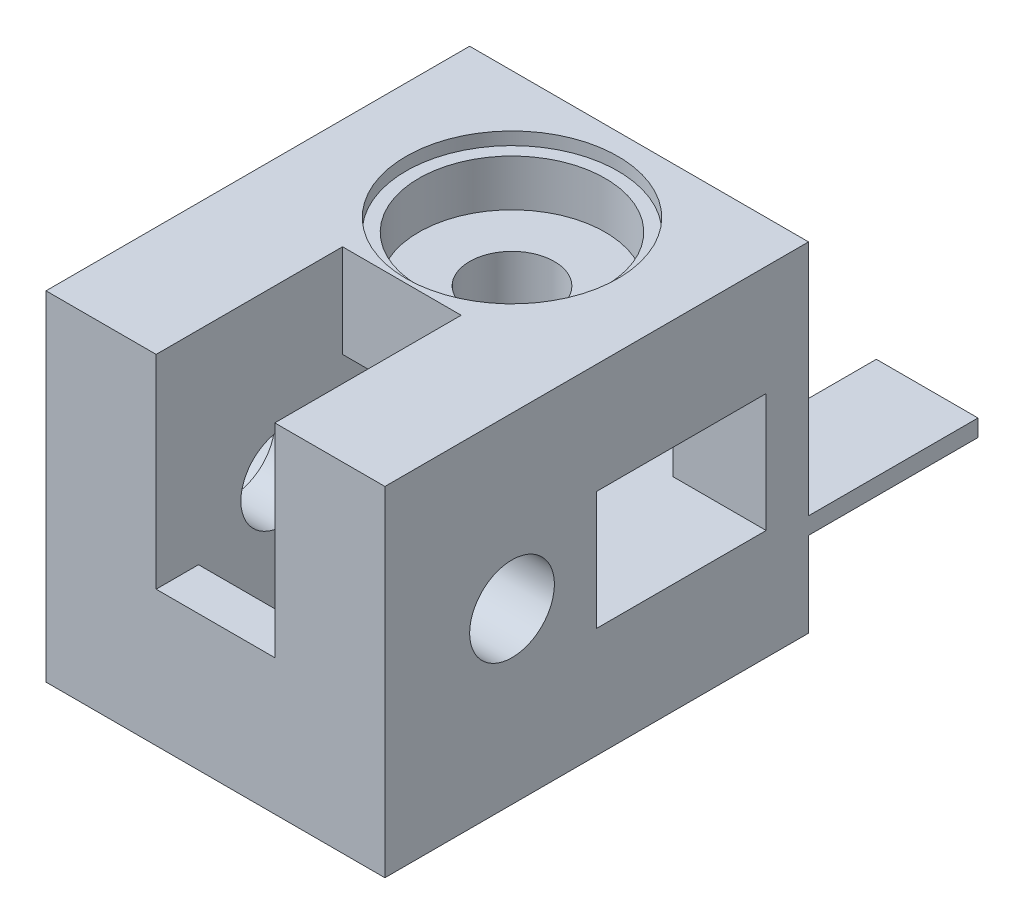
ISO-10303-21;
HEADER;
FILE_DESCRIPTION(('STEP AP214'),'2;1');
FILE_NAME('part.step','',(''),(''),'','','');
FILE_SCHEMA(('AUTOMOTIVE_DESIGN { 1 0 10303 214 1 1 1 1 }'));
ENDSEC;
DATA;
#1=APPLICATION_CONTEXT('core data for automotive mechanical design processes');
#2=APPLICATION_PROTOCOL_DEFINITION('international standard','automotive_design',2000,#1);
#3=PRODUCT_CONTEXT('',#1,'mechanical');
#4=PRODUCT('Part','Part','',(#3));
#5=PRODUCT_RELATED_PRODUCT_CATEGORY('part','',(#4));
#6=PRODUCT_DEFINITION_FORMATION('','',#4);
#7=PRODUCT_DEFINITION_CONTEXT('part definition',#1,'design');
#8=PRODUCT_DEFINITION('design','',#6,#7);
#9=PRODUCT_DEFINITION_SHAPE('','',#8);
#10=(LENGTH_UNIT() NAMED_UNIT(*) SI_UNIT(.MILLI.,.METRE.));
#11=(NAMED_UNIT(*) PLANE_ANGLE_UNIT() SI_UNIT($,.RADIAN.));
#12=(NAMED_UNIT(*) SI_UNIT($,.STERADIAN.) SOLID_ANGLE_UNIT());
#13=UNCERTAINTY_MEASURE_WITH_UNIT(LENGTH_MEASURE(1.E-05),#10,'distance_accuracy_value','');
#14=(GEOMETRIC_REPRESENTATION_CONTEXT(3) GLOBAL_UNCERTAINTY_ASSIGNED_CONTEXT((#13)) GLOBAL_UNIT_ASSIGNED_CONTEXT((#10,
#11,#12)) REPRESENTATION_CONTEXT('',''));
#15=CARTESIAN_POINT('',(0.,0.,0.));
#16=DIRECTION('',(0.,0.,1.));
#17=DIRECTION('',(1.,0.,0.));
#18=AXIS2_PLACEMENT_3D('',#15,#16,#17);
#19=CARTESIAN_POINT('',(0.,0.,0.));
#20=DIRECTION('',(0.,0.,1.));
#21=DIRECTION('',(1.,0.,0.));
#22=AXIS2_PLACEMENT_3D('',#19,#20,#21);
#23=PLANE('',#22);
#24=DIRECTION('',(0.,-1.,0.));
#25=VECTOR('',#24,1.);
#26=CARTESIAN_POINT('',(-10.,10.,0.));
#27=LINE('',#26,#25);
#28=CARTESIAN_POINT('',(-10.,10.,0.));
#29=VERTEX_POINT('',#28);
#30=CARTESIAN_POINT('',(-10.,0.,0.));
#31=VERTEX_POINT('',#30);
#32=EDGE_CURVE('E50',#29,#31,#27,.T.);
#33=ORIENTED_EDGE('',*,*,#32,.F.);
#34=DIRECTION('',(-1.,0.,0.));
#35=VECTOR('',#34,1.);
#36=CARTESIAN_POINT('',(0.,10.,0.));
#37=LINE('',#36,#35);
#38=CARTESIAN_POINT('',(0.,10.,0.));
#39=VERTEX_POINT('',#38);
#40=EDGE_CURVE('E253',#39,#29,#37,.T.);
#41=ORIENTED_EDGE('',*,*,#40,.F.);
#42=DIRECTION('',(0.,1.,0.));
#43=VECTOR('',#42,1.);
#44=CARTESIAN_POINT('',(0.,40.,0.));
#45=LINE('',#44,#43);
#46=CARTESIAN_POINT('',(0.,0.,0.));
#47=VERTEX_POINT('',#46);
#48=EDGE_CURVE('E434',#47,#39,#45,.T.);
#49=ORIENTED_EDGE('',*,*,#48,.F.);
#50=DIRECTION('',(1.,0.,0.));
#51=VECTOR('',#50,1.);
#52=CARTESIAN_POINT('',(-40.,0.,0.));
#53=LINE('',#52,#51);
#54=EDGE_CURVE('E55',#31,#47,#53,.T.);
#55=ORIENTED_EDGE('',*,*,#54,.F.);
#56=EDGE_LOOP('',(#33,#41,#49,#55));
#57=FACE_BOUND('',#56,.T.);
#58=ADVANCED_FACE('F33',(#57),#23,.F.);
#59=DIRECTION('',(1.,0.,0.));
#60=VECTOR('',#59,1.);
#61=CARTESIAN_POINT('',(-12.,12.,0.));
#62=LINE('',#61,#60);
#63=CARTESIAN_POINT('',(-12.,12.,0.));
#64=VERTEX_POINT('',#63);
#65=CARTESIAN_POINT('',(0.,12.,0.));
#66=VERTEX_POINT('',#65);
#67=EDGE_CURVE('E526',#64,#66,#62,.T.);
#68=ORIENTED_EDGE('',*,*,#67,.F.);
#69=DIRECTION('',(0.,1.,0.));
#70=VECTOR('',#69,1.);
#71=CARTESIAN_POINT('',(-12.,0.,0.));
#72=LINE('',#71,#70);
#73=CARTESIAN_POINT('',(-12.,0.,0.));
#74=VERTEX_POINT('',#73);
#75=EDGE_CURVE('E529',#74,#64,#72,.T.);
#76=ORIENTED_EDGE('',*,*,#75,.F.);
#77=CARTESIAN_POINT('',(-40.,0.,0.));
#78=VERTEX_POINT('',#77);
#79=EDGE_CURVE('E237',#78,#74,#53,.T.);
#80=ORIENTED_EDGE('',*,*,#79,.F.);
#81=DIRECTION('',(0.,-1.,0.));
#82=VECTOR('',#81,1.);
#83=CARTESIAN_POINT('',(-40.,40.,0.));
#84=LINE('',#83,#82);
#85=CARTESIAN_POINT('',(-40.,13.,0.));
#86=VERTEX_POINT('',#85);
#87=EDGE_CURVE('E407',#86,#78,#84,.T.);
#88=ORIENTED_EDGE('',*,*,#87,.F.);
#89=DIRECTION('',(-1.,0.,0.));
#90=VECTOR('',#89,1.);
#91=CARTESIAN_POINT('',(-11.,13.,0.));
#92=LINE('',#91,#90);
#93=CARTESIAN_POINT('',(-11.,13.,0.));
#94=VERTEX_POINT('',#93);
#95=EDGE_CURVE('E394',#94,#86,#92,.T.);
#96=ORIENTED_EDGE('',*,*,#95,.F.);
#97=DIRECTION('',(0.,-1.,0.));
#98=VECTOR('',#97,1.);
#99=CARTESIAN_POINT('',(-11.,27.,0.));
#100=LINE('',#99,#98);
#101=CARTESIAN_POINT('',(-11.,27.,0.));
#102=VERTEX_POINT('',#101);
#103=EDGE_CURVE('E376',#102,#94,#100,.T.);
#104=ORIENTED_EDGE('',*,*,#103,.F.);
#105=DIRECTION('',(-1.,0.,0.));
#106=VECTOR('',#105,1.);
#107=CARTESIAN_POINT('',(-11.,27.,0.));
#108=LINE('',#107,#106);
#109=CARTESIAN_POINT('',(-40.,27.,0.));
#110=VERTEX_POINT('',#109);
#111=EDGE_CURVE('E396',#102,#110,#108,.T.);
#112=ORIENTED_EDGE('',*,*,#111,.T.);
#113=CARTESIAN_POINT('',(-40.,40.,0.));
#114=VERTEX_POINT('',#113);
#115=EDGE_CURVE('E421',#114,#110,#84,.T.);
#116=ORIENTED_EDGE('',*,*,#115,.F.);
#117=DIRECTION('',(-1.,0.,0.));
#118=VECTOR('',#117,1.);
#119=CARTESIAN_POINT('',(-40.,40.,0.));
#120=LINE('',#119,#118);
#121=CARTESIAN_POINT('',(0.,40.,0.));
#122=VERTEX_POINT('',#121);
#123=EDGE_CURVE('E412',#122,#114,#120,.T.);
#124=ORIENTED_EDGE('',*,*,#123,.F.);
#125=EDGE_CURVE('E432',#66,#122,#45,.T.);
#126=ORIENTED_EDGE('',*,*,#125,.F.);
#127=EDGE_LOOP('',(#68,#76,#80,#88,#96,#104,#112,#116,#124,#126));
#128=FACE_BOUND('',#127,.T.);
#129=ADVANCED_FACE('F481',(#128),#23,.F.);
#130=CARTESIAN_POINT('',(-33.,20.,35.));
#131=DIRECTION('',(-1.,0.,0.));
#132=DIRECTION('',(0.,0.,1.));
#133=AXIS2_PLACEMENT_3D('',#130,#131,#132);
#134=CYLINDRICAL_SURFACE('',#133,11.);
#135=CARTESIAN_POINT('',(-33.,20.,35.));
#136=DIRECTION('',(-1.,0.,0.));
#137=DIRECTION('',(0.,0.,1.));
#138=AXIS2_PLACEMENT_3D('',#135,#136,#137);
#139=CIRCLE('',#138,11.);
#140=CARTESIAN_POINT('',(-33.,20.,46.));
#141=VERTEX_POINT('',#140);
#142=EDGE_CURVE('E268',#141,#141,#139,.T.);
#143=ORIENTED_EDGE('',*,*,#142,.F.);
#144=EDGE_LOOP('',(#143));
#145=FACE_BOUND('',#144,.T.);
#146=CARTESIAN_POINT('',(-38.5,20.,35.));
#147=DIRECTION('',(-1.,0.,0.));
#148=DIRECTION('',(0.,0.,1.));
#149=AXIS2_PLACEMENT_3D('',#146,#147,#148);
#150=CIRCLE('',#149,11.);
#151=CARTESIAN_POINT('',(-38.5,20.,46.));
#152=VERTEX_POINT('',#151);
#153=EDGE_CURVE('E266',#152,#152,#150,.F.);
#154=ORIENTED_EDGE('',*,*,#153,.F.);
#155=EDGE_LOOP('',(#154));
#156=FACE_BOUND('',#155,.T.);
#157=ADVANCED_FACE('F552',(#145,#156),#134,.F.);
#158=CARTESIAN_POINT('',(0.,20.,35.));
#159=DIRECTION('',(-1.,0.,0.));
#160=DIRECTION('',(0.,0.,1.));
#161=AXIS2_PLACEMENT_3D('',#158,#159,#160);
#162=CYLINDRICAL_SURFACE('',#161,5.);
#163=CARTESIAN_POINT('',(-27.,20.,35.));
#164=DIRECTION('',(-1.,0.,0.));
#165=DIRECTION('',(0.,0.,1.));
#166=AXIS2_PLACEMENT_3D('',#163,#164,#165);
#167=CIRCLE('',#166,5.);
#168=CARTESIAN_POINT('',(-27.,20.,40.));
#169=VERTEX_POINT('',#168);
#170=EDGE_CURVE('E366',#169,#169,#167,.F.);
#171=ORIENTED_EDGE('',*,*,#170,.T.);
#172=EDGE_LOOP('',(#171));
#173=FACE_BOUND('',#172,.T.);
#174=CARTESIAN_POINT('',(-33.,20.,35.));
#175=DIRECTION('',(-1.,0.,0.));
#176=DIRECTION('',(0.,0.,1.));
#177=AXIS2_PLACEMENT_3D('',#174,#175,#176);
#178=CIRCLE('',#177,5.);
#179=CARTESIAN_POINT('',(-33.,20.,40.));
#180=VERTEX_POINT('',#179);
#181=EDGE_CURVE('E271',#180,#180,#178,.F.);
#182=ORIENTED_EDGE('',*,*,#181,.F.);
#183=EDGE_LOOP('',(#182));
#184=FACE_BOUND('',#183,.T.);
#185=ADVANCED_FACE('F583',(#173,#184),#162,.F.);
#186=CARTESIAN_POINT('',(-20.,33.,15.));
#187=DIRECTION('',(0.,1.,0.));
#188=DIRECTION('',(0.,0.,1.));
#189=AXIS2_PLACEMENT_3D('',#186,#187,#188);
#190=CYLINDRICAL_SURFACE('',#189,11.);
#191=CARTESIAN_POINT('',(-20.,33.,15.));
#192=DIRECTION('',(0.,1.,0.));
#193=DIRECTION('',(0.,0.,1.));
#194=AXIS2_PLACEMENT_3D('',#191,#192,#193);
#195=CIRCLE('',#194,11.);
#196=CARTESIAN_POINT('',(-20.,33.,26.));
#197=VERTEX_POINT('',#196);
#198=EDGE_CURVE('E279',#197,#197,#195,.T.);
#199=ORIENTED_EDGE('',*,*,#198,.F.);
#200=EDGE_LOOP('',(#199));
#201=FACE_BOUND('',#200,.T.);
#202=CARTESIAN_POINT('',(-20.,38.5,15.));
#203=DIRECTION('',(0.,1.,0.));
#204=DIRECTION('',(0.,0.,1.));
#205=AXIS2_PLACEMENT_3D('',#202,#203,#204);
#206=CIRCLE('',#205,11.);
#207=CARTESIAN_POINT('',(-20.,38.5,26.));
#208=VERTEX_POINT('',#207);
#209=EDGE_CURVE('E275',#208,#208,#206,.F.);
#210=ORIENTED_EDGE('',*,*,#209,.F.);
#211=EDGE_LOOP('',(#210));
#212=FACE_BOUND('',#211,.T.);
#213=ADVANCED_FACE('F585',(#201,#212),#190,.F.);
#214=CARTESIAN_POINT('',(-20.,0.,15.));
#215=DIRECTION('',(0.,1.,0.));
#216=DIRECTION('',(0.,0.,1.));
#217=AXIS2_PLACEMENT_3D('',#214,#215,#216);
#218=CYLINDRICAL_SURFACE('',#217,5.);
#219=CARTESIAN_POINT('',(-20.,27.,15.));
#220=DIRECTION('',(0.,1.,0.));
#221=DIRECTION('',(0.,0.,1.));
#222=AXIS2_PLACEMENT_3D('',#219,#220,#221);
#223=CIRCLE('',#222,5.);
#224=CARTESIAN_POINT('',(-20.,27.,20.));
#225=VERTEX_POINT('',#224);
#226=EDGE_CURVE('E393',#225,#225,#223,.F.);
#227=ORIENTED_EDGE('',*,*,#226,.T.);
#228=EDGE_LOOP('',(#227));
#229=FACE_BOUND('',#228,.T.);
#230=CARTESIAN_POINT('',(-20.,33.,15.));
#231=DIRECTION('',(0.,1.,0.));
#232=DIRECTION('',(0.,0.,1.));
#233=AXIS2_PLACEMENT_3D('',#230,#231,#232);
#234=CIRCLE('',#233,5.);
#235=CARTESIAN_POINT('',(-20.,33.,20.));
#236=VERTEX_POINT('',#235);
#237=EDGE_CURVE('E282',#236,#236,#234,.F.);
#238=ORIENTED_EDGE('',*,*,#237,.F.);
#239=EDGE_LOOP('',(#238));
#240=FACE_BOUND('',#239,.T.);
#241=ADVANCED_FACE('F577',(#229,#240),#218,.F.);
#242=CARTESIAN_POINT('',(-13.,20.,35.));
#243=DIRECTION('',(1.,0.,0.));
#244=DIRECTION('',(0.,0.,-1.));
#245=AXIS2_PLACEMENT_3D('',#242,#243,#244);
#246=CIRCLE('',#245,5.);
#247=CARTESIAN_POINT('',(-13.,20.,30.));
#248=VERTEX_POINT('',#247);
#249=EDGE_CURVE('E387',#248,#248,#246,.F.);
#250=ORIENTED_EDGE('',*,*,#249,.T.);
#251=EDGE_LOOP('',(#250));
#252=FACE_BOUND('',#251,.T.);
#253=CARTESIAN_POINT('',(0.,20.,35.));
#254=DIRECTION('',(-1.,0.,0.));
#255=DIRECTION('',(0.,0.,1.));
#256=AXIS2_PLACEMENT_3D('',#253,#254,#255);
#257=CIRCLE('',#256,5.);
#258=CARTESIAN_POINT('',(0.,20.,40.));
#259=VERTEX_POINT('',#258);
#260=EDGE_CURVE('E400',#259,#259,#257,.T.);
#261=ORIENTED_EDGE('',*,*,#260,.F.);
#262=EDGE_LOOP('',(#261));
#263=FACE_BOUND('',#262,.T.);
#264=ADVANCED_FACE('F575',(#252,#263),#162,.F.);
#265=CARTESIAN_POINT('',(-20.,13.,15.));
#266=DIRECTION('',(0.,-1.,0.));
#267=DIRECTION('',(0.,0.,-1.));
#268=AXIS2_PLACEMENT_3D('',#265,#266,#267);
#269=CIRCLE('',#268,5.);
#270=CARTESIAN_POINT('',(-20.,13.,10.));
#271=VERTEX_POINT('',#270);
#272=EDGE_CURVE('E404',#271,#271,#269,.F.);
#273=ORIENTED_EDGE('',*,*,#272,.T.);
#274=EDGE_LOOP('',(#273));
#275=FACE_BOUND('',#274,.T.);
#276=CARTESIAN_POINT('',(-20.,0.,15.));
#277=DIRECTION('',(0.,1.,0.));
#278=DIRECTION('',(0.,0.,1.));
#279=AXIS2_PLACEMENT_3D('',#276,#277,#278);
#280=CIRCLE('',#279,5.);
#281=CARTESIAN_POINT('',(-20.,0.,20.));
#282=VERTEX_POINT('',#281);
#283=EDGE_CURVE('E403',#282,#282,#280,.T.);
#284=ORIENTED_EDGE('',*,*,#283,.F.);
#285=EDGE_LOOP('',(#284));
#286=FACE_BOUND('',#285,.T.);
#287=ADVANCED_FACE('F567',(#275,#286),#218,.F.);
#288=CARTESIAN_POINT('',(-40.,40.,50.));
#289=DIRECTION('',(1.,0.,0.));
#290=DIRECTION('',(0.,0.,-1.));
#291=AXIS2_PLACEMENT_3D('',#288,#289,#290);
#292=PLANE('',#291);
#293=CARTESIAN_POINT('',(-40.,20.,35.));
#294=DIRECTION('',(-1.,0.,0.));
#295=DIRECTION('',(0.,0.,1.));
#296=AXIS2_PLACEMENT_3D('',#293,#294,#295);
#297=CIRCLE('',#296,12.5);
#298=CARTESIAN_POINT('',(-40.,20.,47.5));
#299=VERTEX_POINT('',#298);
#300=EDGE_CURVE('E238',#299,#299,#297,.T.);
#301=ORIENTED_EDGE('',*,*,#300,.F.);
#302=EDGE_LOOP('',(#301));
#303=FACE_BOUND('',#302,.T.);
#304=DIRECTION('',(0.,1.,0.));
#305=VECTOR('',#304,1.);
#306=CARTESIAN_POINT('',(-40.,27.,22.));
#307=LINE('',#306,#305);
#308=CARTESIAN_POINT('',(-40.,13.,22.));
#309=VERTEX_POINT('',#308);
#310=CARTESIAN_POINT('',(-40.,27.,22.));
#311=VERTEX_POINT('',#310);
#312=EDGE_CURVE('E383',#309,#311,#307,.T.);
#313=ORIENTED_EDGE('',*,*,#312,.F.);
#314=DIRECTION('',(0.,0.,1.));
#315=VECTOR('',#314,1.);
#316=CARTESIAN_POINT('',(-40.,13.,22.));
#317=LINE('',#316,#315);
#318=EDGE_CURVE('E377',#86,#309,#317,.T.);
#319=ORIENTED_EDGE('',*,*,#318,.F.);
#320=ORIENTED_EDGE('',*,*,#87,.T.);
#321=DIRECTION('',(0.,0.,-1.));
#322=VECTOR('',#321,1.);
#323=CARTESIAN_POINT('',(-40.,0.,50.));
#324=LINE('',#323,#322);
#325=CARTESIAN_POINT('',(-40.,0.,50.));
#326=VERTEX_POINT('',#325);
#327=EDGE_CURVE('E450',#326,#78,#324,.T.);
#328=ORIENTED_EDGE('',*,*,#327,.F.);
#329=DIRECTION('',(0.,-1.,0.));
#330=VECTOR('',#329,1.);
#331=CARTESIAN_POINT('',(-40.,40.,50.));
#332=LINE('',#331,#330);
#333=CARTESIAN_POINT('',(-40.,40.,50.));
#334=VERTEX_POINT('',#333);
#335=EDGE_CURVE('E408',#334,#326,#332,.T.);
#336=ORIENTED_EDGE('',*,*,#335,.F.);
#337=DIRECTION('',(0.,0.,-1.));
#338=VECTOR('',#337,1.);
#339=CARTESIAN_POINT('',(-40.,40.,50.));
#340=LINE('',#339,#338);
#341=EDGE_CURVE('E420',#334,#114,#340,.T.);
#342=ORIENTED_EDGE('',*,*,#341,.T.);
#343=ORIENTED_EDGE('',*,*,#115,.T.);
#344=DIRECTION('',(0.,0.,-1.));
#345=VECTOR('',#344,1.);
#346=CARTESIAN_POINT('',(-40.,27.,22.));
#347=LINE('',#346,#345);
#348=EDGE_CURVE('E386',#311,#110,#347,.T.);
#349=ORIENTED_EDGE('',*,*,#348,.F.);
#350=EDGE_LOOP('',(#313,#319,#320,#328,#336,#342,#343,#349));
#351=FACE_BOUND('',#350,.T.);
#352=ADVANCED_FACE('F35',(#303,#351),#292,.F.);
#353=CARTESIAN_POINT('',(-40.,0.,50.));
#354=DIRECTION('',(0.,1.,0.));
#355=DIRECTION('',(0.,0.,1.));
#356=AXIS2_PLACEMENT_3D('',#353,#354,#355);
#357=PLANE('',#356);
#358=DIRECTION('',(-1.,0.,0.));
#359=VECTOR('',#358,1.);
#360=CARTESIAN_POINT('',(-13.,0.,45.));
#361=LINE('',#360,#359);
#362=CARTESIAN_POINT('',(-13.,0.,45.));
#363=VERTEX_POINT('',#362);
#364=CARTESIAN_POINT('',(-27.,0.,45.));
#365=VERTEX_POINT('',#364);
#366=EDGE_CURVE('E355',#363,#365,#361,.T.);
#367=ORIENTED_EDGE('',*,*,#366,.F.);
#368=DIRECTION('',(0.,0.,1.));
#369=VECTOR('',#368,1.);
#370=CARTESIAN_POINT('',(-13.,0.,25.));
#371=LINE('',#370,#369);
#372=CARTESIAN_POINT('',(-13.,0.,25.));
#373=VERTEX_POINT('',#372);
#374=EDGE_CURVE('E342',#373,#363,#371,.T.);
#375=ORIENTED_EDGE('',*,*,#374,.F.);
#376=DIRECTION('',(1.,0.,0.));
#377=VECTOR('',#376,1.);
#378=CARTESIAN_POINT('',(-13.,0.,25.));
#379=LINE('',#378,#377);
#380=CARTESIAN_POINT('',(-27.,0.,25.));
#381=VERTEX_POINT('',#380);
#382=EDGE_CURVE('E347',#381,#373,#379,.T.);
#383=ORIENTED_EDGE('',*,*,#382,.F.);
#384=DIRECTION('',(0.,0.,-1.));
#385=VECTOR('',#384,1.);
#386=CARTESIAN_POINT('',(-27.,0.,25.));
#387=LINE('',#386,#385);
#388=EDGE_CURVE('E358',#365,#381,#387,.T.);
#389=ORIENTED_EDGE('',*,*,#388,.F.);
#390=EDGE_LOOP('',(#367,#375,#383,#389));
#391=FACE_BOUND('',#390,.T.);
#392=ORIENTED_EDGE('',*,*,#283,.T.);
#393=EDGE_LOOP('',(#392));
#394=FACE_BOUND('',#393,.T.);
#395=ORIENTED_EDGE('',*,*,#79,.T.);
#396=DIRECTION('',(0.,0.,1.));
#397=VECTOR('',#396,1.);
#398=CARTESIAN_POINT('',(-12.,0.,-20.));
#399=LINE('',#398,#397);
#400=CARTESIAN_POINT('',(-12.,0.,-20.));
#401=VERTEX_POINT('',#400);
#402=EDGE_CURVE('E217',#401,#74,#399,.T.);
#403=ORIENTED_EDGE('',*,*,#402,.F.);
#404=DIRECTION('',(-1.,0.,0.));
#405=VECTOR('',#404,1.);
#406=CARTESIAN_POINT('',(-10.,0.,-20.));
#407=LINE('',#406,#405);
#408=CARTESIAN_POINT('',(-10.,0.,-20.));
#409=VERTEX_POINT('',#408);
#410=EDGE_CURVE('E223',#409,#401,#407,.T.);
#411=ORIENTED_EDGE('',*,*,#410,.F.);
#412=DIRECTION('',(0.,0.,1.));
#413=VECTOR('',#412,1.);
#414=CARTESIAN_POINT('',(-10.,0.,-20.));
#415=LINE('',#414,#413);
#416=EDGE_CURVE('E254',#409,#31,#415,.T.);
#417=ORIENTED_EDGE('',*,*,#416,.T.);
#418=ORIENTED_EDGE('',*,*,#54,.T.);
#419=DIRECTION('',(0.,0.,-1.));
#420=VECTOR('',#419,1.);
#421=CARTESIAN_POINT('',(0.,0.,50.));
#422=LINE('',#421,#420);
#423=CARTESIAN_POINT('',(0.,0.,50.));
#424=VERTEX_POINT('',#423);
#425=EDGE_CURVE('E460',#424,#47,#422,.T.);
#426=ORIENTED_EDGE('',*,*,#425,.F.);
#427=DIRECTION('',(1.,0.,0.));
#428=VECTOR('',#427,1.);
#429=CARTESIAN_POINT('',(-40.,0.,50.));
#430=LINE('',#429,#428);
#431=EDGE_CURVE('E411',#326,#424,#430,.T.);
#432=ORIENTED_EDGE('',*,*,#431,.F.);
#433=ORIENTED_EDGE('',*,*,#327,.T.);
#434=EDGE_LOOP('',(#395,#403,#411,#417,#418,#426,#432,#433));
#435=FACE_BOUND('',#434,.T.);
#436=ADVANCED_FACE('F234',(#391,#394,#435),#357,.F.);
#437=CARTESIAN_POINT('',(0.,40.,50.));
#438=DIRECTION('',(-1.,0.,0.));
#439=DIRECTION('',(0.,-1.,0.));
#440=AXIS2_PLACEMENT_3D('',#437,#438,#439);
#441=PLANE('',#440);
#442=DIRECTION('',(0.,0.,-1.));
#443=VECTOR('',#442,1.);
#444=CARTESIAN_POINT('',(0.,13.,5.));
#445=LINE('',#444,#443);
#446=CARTESIAN_POINT('',(0.,13.,25.));
#447=VERTEX_POINT('',#446);
#448=CARTESIAN_POINT('',(0.,13.,5.));
#449=VERTEX_POINT('',#448);
#450=EDGE_CURVE('E320',#447,#449,#445,.T.);
#451=ORIENTED_EDGE('',*,*,#450,.F.);
#452=DIRECTION('',(0.,-1.,0.));
#453=VECTOR('',#452,1.);
#454=CARTESIAN_POINT('',(0.,27.,25.));
#455=LINE('',#454,#453);
#456=CARTESIAN_POINT('',(0.,27.,25.));
#457=VERTEX_POINT('',#456);
#458=EDGE_CURVE('E302',#457,#447,#455,.T.);
#459=ORIENTED_EDGE('',*,*,#458,.F.);
#460=DIRECTION('',(0.,0.,1.));
#461=VECTOR('',#460,1.);
#462=CARTESIAN_POINT('',(0.,27.,5.));
#463=LINE('',#462,#461);
#464=CARTESIAN_POINT('',(0.,27.,5.));
#465=VERTEX_POINT('',#464);
#466=EDGE_CURVE('E313',#465,#457,#463,.T.);
#467=ORIENTED_EDGE('',*,*,#466,.F.);
#468=DIRECTION('',(0.,1.,0.));
#469=VECTOR('',#468,1.);
#470=CARTESIAN_POINT('',(0.,27.,5.));
#471=LINE('',#470,#469);
#472=EDGE_CURVE('E323',#449,#465,#471,.T.);
#473=ORIENTED_EDGE('',*,*,#472,.F.);
#474=EDGE_LOOP('',(#451,#459,#467,#473));
#475=FACE_BOUND('',#474,.T.);
#476=ORIENTED_EDGE('',*,*,#260,.T.);
#477=EDGE_LOOP('',(#476));
#478=FACE_BOUND('',#477,.T.);
#479=ORIENTED_EDGE('',*,*,#48,.T.);
#480=DIRECTION('',(0.,0.,1.));
#481=VECTOR('',#480,1.);
#482=CARTESIAN_POINT('',(0.,10.,-20.));
#483=LINE('',#482,#481);
#484=CARTESIAN_POINT('',(0.,10.,-20.));
#485=VERTEX_POINT('',#484);
#486=EDGE_CURVE('E263',#485,#39,#483,.T.);
#487=ORIENTED_EDGE('',*,*,#486,.F.);
#488=DIRECTION('',(0.,-1.,0.));
#489=VECTOR('',#488,1.);
#490=CARTESIAN_POINT('',(0.,12.,-20.));
#491=LINE('',#490,#489);
#492=CARTESIAN_POINT('',(0.,12.,-20.));
#493=VERTEX_POINT('',#492);
#494=EDGE_CURVE('E545',#493,#485,#491,.T.);
#495=ORIENTED_EDGE('',*,*,#494,.F.);
#496=DIRECTION('',(0.,0.,1.));
#497=VECTOR('',#496,1.);
#498=CARTESIAN_POINT('',(0.,12.,-20.));
#499=LINE('',#498,#497);
#500=EDGE_CURVE('E243',#493,#66,#499,.T.);
#501=ORIENTED_EDGE('',*,*,#500,.T.);
#502=ORIENTED_EDGE('',*,*,#125,.T.);
#503=DIRECTION('',(0.,0.,-1.));
#504=VECTOR('',#503,1.);
#505=CARTESIAN_POINT('',(0.,40.,50.));
#506=LINE('',#505,#504);
#507=CARTESIAN_POINT('',(0.,40.,50.));
#508=VERTEX_POINT('',#507);
#509=EDGE_CURVE('E463',#508,#122,#506,.T.);
#510=ORIENTED_EDGE('',*,*,#509,.F.);
#511=DIRECTION('',(0.,1.,0.));
#512=VECTOR('',#511,1.);
#513=CARTESIAN_POINT('',(0.,40.,50.));
#514=LINE('',#513,#512);
#515=EDGE_CURVE('E414',#424,#508,#514,.T.);
#516=ORIENTED_EDGE('',*,*,#515,.F.);
#517=ORIENTED_EDGE('',*,*,#425,.T.);
#518=EDGE_LOOP('',(#479,#487,#495,#501,#502,#510,#516,#517));
#519=FACE_BOUND('',#518,.T.);
#520=ADVANCED_FACE('F521',(#475,#478,#519),#441,.F.);
#521=CARTESIAN_POINT('',(-40.,40.,50.));
#522=DIRECTION('',(0.,-1.,0.));
#523=DIRECTION('',(0.,0.,-1.));
#524=AXIS2_PLACEMENT_3D('',#521,#522,#523);
#525=PLANE('',#524);
#526=CARTESIAN_POINT('',(-20.,40.,15.));
#527=DIRECTION('',(0.,1.,0.));
#528=DIRECTION('',(0.,0.,1.));
#529=AXIS2_PLACEMENT_3D('',#526,#527,#528);
#530=CIRCLE('',#529,12.5);
#531=CARTESIAN_POINT('',(-20.,40.,27.5));
#532=VERTEX_POINT('',#531);
#533=EDGE_CURVE('E276',#532,#532,#530,.T.);
#534=ORIENTED_EDGE('',*,*,#533,.F.);
#535=EDGE_LOOP('',(#534));
#536=FACE_BOUND('',#535,.T.);
#537=DIRECTION('',(-1.,0.,0.));
#538=VECTOR('',#537,1.);
#539=CARTESIAN_POINT('',(-40.,40.,50.));
#540=LINE('',#539,#538);
#541=CARTESIAN_POINT('',(-27.,40.,50.));
#542=VERTEX_POINT('',#541);
#543=EDGE_CURVE('E416',#542,#334,#540,.T.);
#544=ORIENTED_EDGE('',*,*,#543,.F.);
#545=DIRECTION('',(0.,0.,1.));
#546=VECTOR('',#545,1.);
#547=CARTESIAN_POINT('',(-27.,40.,50.));
#548=LINE('',#547,#546);
#549=CARTESIAN_POINT('',(-27.,40.,28.));
#550=VERTEX_POINT('',#549);
#551=EDGE_CURVE('E293',#550,#542,#548,.T.);
#552=ORIENTED_EDGE('',*,*,#551,.F.);
#553=DIRECTION('',(-1.,0.,0.));
#554=VECTOR('',#553,1.);
#555=CARTESIAN_POINT('',(-27.,40.,28.));
#556=LINE('',#555,#554);
#557=CARTESIAN_POINT('',(-13.,40.,28.));
#558=VERTEX_POINT('',#557);
#559=EDGE_CURVE('E287',#558,#550,#556,.T.);
#560=ORIENTED_EDGE('',*,*,#559,.F.);
#561=DIRECTION('',(0.,0.,-1.));
#562=VECTOR('',#561,1.);
#563=CARTESIAN_POINT('',(-13.,40.,50.));
#564=LINE('',#563,#562);
#565=CARTESIAN_POINT('',(-13.,40.,50.));
#566=VERTEX_POINT('',#565);
#567=EDGE_CURVE('E295',#566,#558,#564,.T.);
#568=ORIENTED_EDGE('',*,*,#567,.F.);
#569=EDGE_CURVE('E417',#508,#566,#540,.T.);
#570=ORIENTED_EDGE('',*,*,#569,.F.);
#571=ORIENTED_EDGE('',*,*,#509,.T.);
#572=ORIENTED_EDGE('',*,*,#123,.T.);
#573=ORIENTED_EDGE('',*,*,#341,.F.);
#574=EDGE_LOOP('',(#544,#552,#560,#568,#570,#571,#572,#573));
#575=FACE_BOUND('',#574,.T.);
#576=ADVANCED_FACE('F471',(#536,#575),#525,.F.);
#577=CARTESIAN_POINT('',(0.,0.,50.));
#578=DIRECTION('',(0.,0.,1.));
#579=DIRECTION('',(1.,0.,0.));
#580=AXIS2_PLACEMENT_3D('',#577,#578,#579);
#581=PLANE('',#580);
#582=DIRECTION('',(0.,1.,0.));
#583=VECTOR('',#582,1.);
#584=CARTESIAN_POINT('',(-27.,16.,50.));
#585=LINE('',#584,#583);
#586=CARTESIAN_POINT('',(-27.,16.,50.));
#587=VERTEX_POINT('',#586);
#588=EDGE_CURVE('E292',#587,#542,#585,.T.);
#589=ORIENTED_EDGE('',*,*,#588,.T.);
#590=ORIENTED_EDGE('',*,*,#543,.T.);
#591=ORIENTED_EDGE('',*,*,#335,.T.);
#592=ORIENTED_EDGE('',*,*,#431,.T.);
#593=ORIENTED_EDGE('',*,*,#515,.T.);
#594=ORIENTED_EDGE('',*,*,#569,.T.);
#595=DIRECTION('',(0.,1.,0.));
#596=VECTOR('',#595,1.);
#597=CARTESIAN_POINT('',(-13.,16.,50.));
#598=LINE('',#597,#596);
#599=CARTESIAN_POINT('',(-13.,16.,50.));
#600=VERTEX_POINT('',#599);
#601=EDGE_CURVE('E305',#600,#566,#598,.T.);
#602=ORIENTED_EDGE('',*,*,#601,.F.);
#603=DIRECTION('',(1.,0.,0.));
#604=VECTOR('',#603,1.);
#605=CARTESIAN_POINT('',(-27.,16.,50.));
#606=LINE('',#605,#604);
#607=EDGE_CURVE('E286',#587,#600,#606,.T.);
#608=ORIENTED_EDGE('',*,*,#607,.F.);
#609=EDGE_LOOP('',(#589,#590,#591,#592,#593,#594,#602,#608));
#610=FACE_BOUND('',#609,.T.);
#611=ADVANCED_FACE('F502',(#610),#581,.T.);
#612=CARTESIAN_POINT('',(-11.,13.,22.));
#613=DIRECTION('',(0.,-1.,0.));
#614=DIRECTION('',(0.,0.,-1.));
#615=AXIS2_PLACEMENT_3D('',#612,#613,#614);
#616=PLANE('',#615);
#617=DIRECTION('',(1.,0.,0.));
#618=VECTOR('',#617,1.);
#619=CARTESIAN_POINT('',(-24.,13.,5.));
#620=LINE('',#619,#618);
#621=CARTESIAN_POINT('',(-11.,13.,5.));
#622=VERTEX_POINT('',#621);
#623=EDGE_CURVE('E335',#622,#449,#620,.T.);
#624=ORIENTED_EDGE('',*,*,#623,.F.);
#625=DIRECTION('',(0.,0.,1.));
#626=VECTOR('',#625,1.);
#627=CARTESIAN_POINT('',(-11.,13.,22.));
#628=LINE('',#627,#626);
#629=EDGE_CURVE('E379',#94,#622,#628,.T.);
#630=ORIENTED_EDGE('',*,*,#629,.F.);
#631=ORIENTED_EDGE('',*,*,#95,.T.);
#632=ORIENTED_EDGE('',*,*,#318,.T.);
#633=DIRECTION('',(-1.,0.,0.));
#634=VECTOR('',#633,1.);
#635=CARTESIAN_POINT('',(-11.,13.,22.));
#636=LINE('',#635,#634);
#637=CARTESIAN_POINT('',(-24.,13.,22.));
#638=VERTEX_POINT('',#637);
#639=EDGE_CURVE('E391',#638,#309,#636,.T.);
#640=ORIENTED_EDGE('',*,*,#639,.F.);
#641=DIRECTION('',(0.,0.,-1.));
#642=VECTOR('',#641,1.);
#643=CARTESIAN_POINT('',(-24.,13.,5.));
#644=LINE('',#643,#642);
#645=CARTESIAN_POINT('',(-24.,13.,25.));
#646=VERTEX_POINT('',#645);
#647=EDGE_CURVE('E312',#646,#638,#644,.T.);
#648=ORIENTED_EDGE('',*,*,#647,.F.);
#649=DIRECTION('',(1.,0.,0.));
#650=VECTOR('',#649,1.);
#651=CARTESIAN_POINT('',(-24.,13.,25.));
#652=LINE('',#651,#650);
#653=CARTESIAN_POINT('',(-13.,13.,25.));
#654=VERTEX_POINT('',#653);
#655=EDGE_CURVE('E337',#646,#654,#652,.T.);
#656=ORIENTED_EDGE('',*,*,#655,.T.);
#657=EDGE_CURVE('E318',#654,#447,#652,.T.);
#658=ORIENTED_EDGE('',*,*,#657,.T.);
#659=ORIENTED_EDGE('',*,*,#450,.T.);
#660=EDGE_LOOP('',(#624,#630,#631,#632,#640,#648,#656,#658,#659));
#661=FACE_BOUND('',#660,.T.);
#662=ORIENTED_EDGE('',*,*,#272,.F.);
#663=EDGE_LOOP('',(#662));
#664=FACE_BOUND('',#663,.T.);
#665=ADVANCED_FACE('F496',(#661,#664),#616,.F.);
#666=CARTESIAN_POINT('',(-11.,27.,22.));
#667=DIRECTION('',(0.,1.,0.));
#668=DIRECTION('',(0.,0.,1.));
#669=AXIS2_PLACEMENT_3D('',#666,#667,#668);
#670=PLANE('',#669);
#671=ORIENTED_EDGE('',*,*,#226,.F.);
#672=EDGE_LOOP('',(#671));
#673=FACE_BOUND('',#672,.T.);
#674=DIRECTION('',(0.,0.,-1.));
#675=VECTOR('',#674,1.);
#676=CARTESIAN_POINT('',(-11.,27.,22.));
#677=LINE('',#676,#675);
#678=CARTESIAN_POINT('',(-11.,27.,5.));
#679=VERTEX_POINT('',#678);
#680=EDGE_CURVE('E374',#679,#102,#677,.T.);
#681=ORIENTED_EDGE('',*,*,#680,.F.);
#682=DIRECTION('',(1.,0.,0.));
#683=VECTOR('',#682,1.);
#684=CARTESIAN_POINT('',(-24.,27.,5.));
#685=LINE('',#684,#683);
#686=EDGE_CURVE('E333',#679,#465,#685,.T.);
#687=ORIENTED_EDGE('',*,*,#686,.T.);
#688=ORIENTED_EDGE('',*,*,#466,.T.);
#689=DIRECTION('',(1.,0.,0.));
#690=VECTOR('',#689,1.);
#691=CARTESIAN_POINT('',(-24.,27.,25.));
#692=LINE('',#691,#690);
#693=CARTESIAN_POINT('',(-13.,27.,25.));
#694=VERTEX_POINT('',#693);
#695=EDGE_CURVE('E332',#694,#457,#692,.T.);
#696=ORIENTED_EDGE('',*,*,#695,.F.);
#697=CARTESIAN_POINT('',(-24.,27.,25.));
#698=VERTEX_POINT('',#697);
#699=EDGE_CURVE('E328',#698,#694,#692,.T.);
#700=ORIENTED_EDGE('',*,*,#699,.F.);
#701=DIRECTION('',(0.,0.,1.));
#702=VECTOR('',#701,1.);
#703=CARTESIAN_POINT('',(-24.,27.,5.));
#704=LINE('',#703,#702);
#705=CARTESIAN_POINT('',(-24.,27.,22.));
#706=VERTEX_POINT('',#705);
#707=EDGE_CURVE('E315',#706,#698,#704,.T.);
#708=ORIENTED_EDGE('',*,*,#707,.F.);
#709=DIRECTION('',(-1.,0.,0.));
#710=VECTOR('',#709,1.);
#711=CARTESIAN_POINT('',(-11.,27.,22.));
#712=LINE('',#711,#710);
#713=EDGE_CURVE('E382',#706,#311,#712,.T.);
#714=ORIENTED_EDGE('',*,*,#713,.T.);
#715=ORIENTED_EDGE('',*,*,#348,.T.);
#716=ORIENTED_EDGE('',*,*,#111,.F.);
#717=EDGE_LOOP('',(#681,#687,#688,#696,#700,#708,#714,#715,#716));
#718=FACE_BOUND('',#717,.T.);
#719=ADVANCED_FACE('F487',(#673,#718),#670,.F.);
#720=CARTESIAN_POINT('',(-11.,27.,22.));
#721=DIRECTION('',(0.,0.,1.));
#722=DIRECTION('',(1.,0.,0.));
#723=AXIS2_PLACEMENT_3D('',#720,#721,#722);
#724=PLANE('',#723);
#725=ORIENTED_EDGE('',*,*,#713,.F.);
#726=DIRECTION('',(0.,-1.,0.));
#727=VECTOR('',#726,1.);
#728=CARTESIAN_POINT('',(-24.,27.,22.));
#729=LINE('',#728,#727);
#730=EDGE_CURVE('E331',#706,#638,#729,.T.);
#731=ORIENTED_EDGE('',*,*,#730,.T.);
#732=ORIENTED_EDGE('',*,*,#639,.T.);
#733=ORIENTED_EDGE('',*,*,#312,.T.);
#734=EDGE_LOOP('',(#725,#731,#732,#733));
#735=FACE_BOUND('',#734,.T.);
#736=ADVANCED_FACE('F493',(#735),#724,.F.);
#737=CARTESIAN_POINT('',(-11.,0.,0.));
#738=DIRECTION('',(1.,0.,0.));
#739=DIRECTION('',(0.,0.,-1.));
#740=AXIS2_PLACEMENT_3D('',#737,#738,#739);
#741=PLANE('',#740);
#742=ORIENTED_EDGE('',*,*,#629,.T.);
#743=DIRECTION('',(0.,1.,0.));
#744=VECTOR('',#743,1.);
#745=CARTESIAN_POINT('',(-11.,0.,5.));
#746=LINE('',#745,#744);
#747=EDGE_CURVE('E447',#622,#679,#746,.T.);
#748=ORIENTED_EDGE('',*,*,#747,.T.);
#749=ORIENTED_EDGE('',*,*,#680,.T.);
#750=ORIENTED_EDGE('',*,*,#103,.T.);
#751=EDGE_LOOP('',(#742,#748,#749,#750));
#752=FACE_BOUND('',#751,.T.);
#753=ADVANCED_FACE('F644',(#752),#741,.F.);
#754=CARTESIAN_POINT('',(-13.,29.,25.));
#755=DIRECTION('',(1.,0.,0.));
#756=DIRECTION('',(0.,0.,-1.));
#757=AXIS2_PLACEMENT_3D('',#754,#755,#756);
#758=PLANE('',#757);
#759=DIRECTION('',(0.,1.,0.));
#760=VECTOR('',#759,1.);
#761=CARTESIAN_POINT('',(-13.,16.,28.));
#762=LINE('',#761,#760);
#763=CARTESIAN_POINT('',(-13.,29.,28.));
#764=VERTEX_POINT('',#763);
#765=EDGE_CURVE('E303',#764,#558,#762,.T.);
#766=ORIENTED_EDGE('',*,*,#765,.F.);
#767=DIRECTION('',(0.,0.,1.));
#768=VECTOR('',#767,1.);
#769=CARTESIAN_POINT('',(-13.,29.,25.));
#770=LINE('',#769,#768);
#771=CARTESIAN_POINT('',(-13.,29.,25.));
#772=VERTEX_POINT('',#771);
#773=EDGE_CURVE('E343',#772,#764,#770,.T.);
#774=ORIENTED_EDGE('',*,*,#773,.F.);
#775=DIRECTION('',(0.,-1.,0.));
#776=VECTOR('',#775,1.);
#777=CARTESIAN_POINT('',(-13.,29.,25.));
#778=LINE('',#777,#776);
#779=EDGE_CURVE('E363',#772,#694,#778,.T.);
#780=ORIENTED_EDGE('',*,*,#779,.T.);
#781=EDGE_CURVE('E367',#694,#654,#778,.T.);
#782=ORIENTED_EDGE('',*,*,#781,.T.);
#783=EDGE_CURVE('E368',#654,#373,#778,.T.);
#784=ORIENTED_EDGE('',*,*,#783,.T.);
#785=ORIENTED_EDGE('',*,*,#374,.T.);
#786=DIRECTION('',(0.,-1.,0.));
#787=VECTOR('',#786,1.);
#788=CARTESIAN_POINT('',(-13.,29.,45.));
#789=LINE('',#788,#787);
#790=CARTESIAN_POINT('',(-13.,16.,45.));
#791=VERTEX_POINT('',#790);
#792=EDGE_CURVE('E352',#791,#363,#789,.T.);
#793=ORIENTED_EDGE('',*,*,#792,.F.);
#794=DIRECTION('',(0.,0.,-1.));
#795=VECTOR('',#794,1.);
#796=CARTESIAN_POINT('',(-13.,16.,50.));
#797=LINE('',#796,#795);
#798=EDGE_CURVE('E290',#600,#791,#797,.T.);
#799=ORIENTED_EDGE('',*,*,#798,.F.);
#800=ORIENTED_EDGE('',*,*,#601,.T.);
#801=ORIENTED_EDGE('',*,*,#567,.T.);
#802=EDGE_LOOP('',(#766,#774,#780,#782,#784,#785,#793,#799,#800,#801));
#803=FACE_BOUND('',#802,.T.);
#804=ORIENTED_EDGE('',*,*,#249,.F.);
#805=EDGE_LOOP('',(#804));
#806=FACE_BOUND('',#805,.T.);
#807=ADVANCED_FACE('F517',(#803,#806),#758,.F.);
#808=CARTESIAN_POINT('',(-27.,29.,25.));
#809=DIRECTION('',(-1.,0.,0.));
#810=DIRECTION('',(0.,0.,1.));
#811=AXIS2_PLACEMENT_3D('',#808,#809,#810);
#812=PLANE('',#811);
#813=ORIENTED_EDGE('',*,*,#170,.F.);
#814=EDGE_LOOP('',(#813));
#815=FACE_BOUND('',#814,.T.);
#816=DIRECTION('',(0.,0.,-1.));
#817=VECTOR('',#816,1.);
#818=CARTESIAN_POINT('',(-27.,29.,25.));
#819=LINE('',#818,#817);
#820=CARTESIAN_POINT('',(-27.,29.,28.));
#821=VERTEX_POINT('',#820);
#822=CARTESIAN_POINT('',(-27.,29.,25.));
#823=VERTEX_POINT('',#822);
#824=EDGE_CURVE('E346',#821,#823,#819,.T.);
#825=ORIENTED_EDGE('',*,*,#824,.F.);
#826=DIRECTION('',(0.,1.,0.));
#827=VECTOR('',#826,1.);
#828=CARTESIAN_POINT('',(-27.,16.,28.));
#829=LINE('',#828,#827);
#830=EDGE_CURVE('E300',#821,#550,#829,.T.);
#831=ORIENTED_EDGE('',*,*,#830,.T.);
#832=ORIENTED_EDGE('',*,*,#551,.T.);
#833=ORIENTED_EDGE('',*,*,#588,.F.);
#834=DIRECTION('',(0.,0.,1.));
#835=VECTOR('',#834,1.);
#836=CARTESIAN_POINT('',(-27.,16.,50.));
#837=LINE('',#836,#835);
#838=CARTESIAN_POINT('',(-27.,16.,45.));
#839=VERTEX_POINT('',#838);
#840=EDGE_CURVE('E283',#839,#587,#837,.T.);
#841=ORIENTED_EDGE('',*,*,#840,.F.);
#842=DIRECTION('',(0.,-1.,0.));
#843=VECTOR('',#842,1.);
#844=CARTESIAN_POINT('',(-27.,29.,45.));
#845=LINE('',#844,#843);
#846=EDGE_CURVE('E371',#839,#365,#845,.T.);
#847=ORIENTED_EDGE('',*,*,#846,.T.);
#848=ORIENTED_EDGE('',*,*,#388,.T.);
#849=DIRECTION('',(0.,-1.,0.));
#850=VECTOR('',#849,1.);
#851=CARTESIAN_POINT('',(-27.,29.,25.));
#852=LINE('',#851,#850);
#853=EDGE_CURVE('E369',#823,#381,#852,.T.);
#854=ORIENTED_EDGE('',*,*,#853,.F.);
#855=EDGE_LOOP('',(#825,#831,#832,#833,#841,#847,#848,#854));
#856=FACE_BOUND('',#855,.T.);
#857=ADVANCED_FACE('F509',(#815,#856),#812,.F.);
#858=CARTESIAN_POINT('',(-13.,29.,25.));
#859=DIRECTION('',(0.,0.,-1.));
#860=DIRECTION('',(-1.,0.,0.));
#861=AXIS2_PLACEMENT_3D('',#858,#859,#860);
#862=PLANE('',#861);
#863=DIRECTION('',(0.,-1.,0.));
#864=VECTOR('',#863,1.);
#865=CARTESIAN_POINT('',(-24.,27.,25.));
#866=LINE('',#865,#864);
#867=EDGE_CURVE('E309',#698,#646,#866,.T.);
#868=ORIENTED_EDGE('',*,*,#867,.F.);
#869=ORIENTED_EDGE('',*,*,#699,.T.);
#870=ORIENTED_EDGE('',*,*,#779,.F.);
#871=DIRECTION('',(1.,0.,0.));
#872=VECTOR('',#871,1.);
#873=CARTESIAN_POINT('',(-13.,29.,25.));
#874=LINE('',#873,#872);
#875=EDGE_CURVE('E349',#823,#772,#874,.T.);
#876=ORIENTED_EDGE('',*,*,#875,.F.);
#877=ORIENTED_EDGE('',*,*,#853,.T.);
#878=ORIENTED_EDGE('',*,*,#382,.T.);
#879=ORIENTED_EDGE('',*,*,#783,.F.);
#880=ORIENTED_EDGE('',*,*,#655,.F.);
#881=EDGE_LOOP('',(#868,#869,#870,#876,#877,#878,#879,#880));
#882=FACE_BOUND('',#881,.T.);
#883=ADVANCED_FACE('F632',(#882),#862,.F.);
#884=CARTESIAN_POINT('',(-13.,29.,45.));
#885=DIRECTION('',(0.,0.,1.));
#886=DIRECTION('',(1.,0.,0.));
#887=AXIS2_PLACEMENT_3D('',#884,#885,#886);
#888=PLANE('',#887);
#889=ORIENTED_EDGE('',*,*,#846,.F.);
#890=DIRECTION('',(1.,0.,0.));
#891=VECTOR('',#890,1.);
#892=CARTESIAN_POINT('',(-13.,16.,45.));
#893=LINE('',#892,#891);
#894=EDGE_CURVE('E11',#839,#791,#893,.T.);
#895=ORIENTED_EDGE('',*,*,#894,.T.);
#896=ORIENTED_EDGE('',*,*,#792,.T.);
#897=ORIENTED_EDGE('',*,*,#366,.T.);
#898=EDGE_LOOP('',(#889,#895,#896,#897));
#899=FACE_BOUND('',#898,.T.);
#900=ADVANCED_FACE('F630',(#899),#888,.F.);
#901=CARTESIAN_POINT('',(0.,29.,0.));
#902=DIRECTION('',(0.,-1.,0.));
#903=DIRECTION('',(0.,0.,-1.));
#904=AXIS2_PLACEMENT_3D('',#901,#902,#903);
#905=PLANE('',#904);
#906=DIRECTION('',(1.,0.,0.));
#907=VECTOR('',#906,1.);
#908=CARTESIAN_POINT('',(0.,29.,28.));
#909=LINE('',#908,#907);
#910=EDGE_CURVE('E42',#821,#764,#909,.T.);
#911=ORIENTED_EDGE('',*,*,#910,.F.);
#912=ORIENTED_EDGE('',*,*,#824,.T.);
#913=ORIENTED_EDGE('',*,*,#875,.T.);
#914=ORIENTED_EDGE('',*,*,#773,.T.);
#915=EDGE_LOOP('',(#911,#912,#913,#914));
#916=FACE_BOUND('',#915,.T.);
#917=ADVANCED_FACE('F623',(#916),#905,.T.);
#918=CARTESIAN_POINT('',(-24.,27.,5.));
#919=DIRECTION('',(0.,0.,-1.));
#920=DIRECTION('',(0.,1.,0.));
#921=AXIS2_PLACEMENT_3D('',#918,#919,#920);
#922=PLANE('',#921);
#923=ORIENTED_EDGE('',*,*,#623,.T.);
#924=ORIENTED_EDGE('',*,*,#472,.T.);
#925=ORIENTED_EDGE('',*,*,#686,.F.);
#926=ORIENTED_EDGE('',*,*,#747,.F.);
#927=EDGE_LOOP('',(#923,#924,#925,#926));
#928=FACE_BOUND('',#927,.T.);
#929=ADVANCED_FACE('F620',(#928),#922,.F.);
#930=CARTESIAN_POINT('',(-24.,27.,25.));
#931=DIRECTION('',(0.,0.,1.));
#932=DIRECTION('',(1.,0.,0.));
#933=AXIS2_PLACEMENT_3D('',#930,#931,#932);
#934=PLANE('',#933);
#935=ORIENTED_EDGE('',*,*,#695,.T.);
#936=ORIENTED_EDGE('',*,*,#458,.T.);
#937=ORIENTED_EDGE('',*,*,#657,.F.);
#938=ORIENTED_EDGE('',*,*,#781,.F.);
#939=EDGE_LOOP('',(#935,#936,#937,#938));
#940=FACE_BOUND('',#939,.T.);
#941=ADVANCED_FACE('F618',(#940),#934,.F.);
#942=CARTESIAN_POINT('',(-24.,0.,0.));
#943=DIRECTION('',(-1.,0.,0.));
#944=DIRECTION('',(0.,-1.,0.));
#945=AXIS2_PLACEMENT_3D('',#942,#943,#944);
#946=PLANE('',#945);
#947=ORIENTED_EDGE('',*,*,#707,.T.);
#948=ORIENTED_EDGE('',*,*,#867,.T.);
#949=ORIENTED_EDGE('',*,*,#647,.T.);
#950=ORIENTED_EDGE('',*,*,#730,.F.);
#951=EDGE_LOOP('',(#947,#948,#949,#950));
#952=FACE_BOUND('',#951,.T.);
#953=ADVANCED_FACE('F613',(#952),#946,.F.);
#954=CARTESIAN_POINT('',(0.,16.,0.));
#955=DIRECTION('',(0.,-1.,0.));
#956=DIRECTION('',(0.,0.,-1.));
#957=AXIS2_PLACEMENT_3D('',#954,#955,#956);
#958=PLANE('',#957);
#959=ORIENTED_EDGE('',*,*,#840,.T.);
#960=ORIENTED_EDGE('',*,*,#607,.T.);
#961=ORIENTED_EDGE('',*,*,#798,.T.);
#962=ORIENTED_EDGE('',*,*,#894,.F.);
#963=EDGE_LOOP('',(#959,#960,#961,#962));
#964=FACE_BOUND('',#963,.T.);
#965=ADVANCED_FACE('F608',(#964),#958,.F.);
#966=CARTESIAN_POINT('',(-27.,16.,28.));
#967=DIRECTION('',(0.,0.,-1.));
#968=DIRECTION('',(-1.,0.,0.));
#969=AXIS2_PLACEMENT_3D('',#966,#967,#968);
#970=PLANE('',#969);
#971=ORIENTED_EDGE('',*,*,#910,.T.);
#972=ORIENTED_EDGE('',*,*,#765,.T.);
#973=ORIENTED_EDGE('',*,*,#559,.T.);
#974=ORIENTED_EDGE('',*,*,#830,.F.);
#975=EDGE_LOOP('',(#971,#972,#973,#974));
#976=FACE_BOUND('',#975,.T.);
#977=ADVANCED_FACE('F514',(#976),#970,.F.);
#978=CARTESIAN_POINT('',(-20.,33.,15.));
#979=DIRECTION('',(0.,1.,0.));
#980=DIRECTION('',(0.,0.,1.));
#981=AXIS2_PLACEMENT_3D('',#978,#979,#980);
#982=PLANE('',#981);
#983=ORIENTED_EDGE('',*,*,#198,.T.);
#984=EDGE_LOOP('',(#983));
#985=FACE_BOUND('',#984,.T.);
#986=ORIENTED_EDGE('',*,*,#237,.T.);
#987=EDGE_LOOP('',(#986));
#988=FACE_BOUND('',#987,.T.);
#989=ADVANCED_FACE('F596',(#985,#988),#982,.T.);
#990=CARTESIAN_POINT('',(-20.,38.5,15.));
#991=DIRECTION('',(0.,1.,0.));
#992=DIRECTION('',(0.,0.,1.));
#993=AXIS2_PLACEMENT_3D('',#990,#991,#992);
#994=PLANE('',#993);
#995=CARTESIAN_POINT('',(-20.,38.5,15.));
#996=DIRECTION('',(0.,1.,0.));
#997=DIRECTION('',(0.,0.,1.));
#998=AXIS2_PLACEMENT_3D('',#995,#996,#997);
#999=CIRCLE('',#998,12.5);
#1000=CARTESIAN_POINT('',(-20.,38.5,27.5));
#1001=VERTEX_POINT('',#1000);
#1002=EDGE_CURVE('E272',#1001,#1001,#999,.T.);
#1003=ORIENTED_EDGE('',*,*,#1002,.T.);
#1004=EDGE_LOOP('',(#1003));
#1005=FACE_BOUND('',#1004,.T.);
#1006=ORIENTED_EDGE('',*,*,#209,.T.);
#1007=EDGE_LOOP('',(#1006));
#1008=FACE_BOUND('',#1007,.T.);
#1009=ADVANCED_FACE('F598',(#1005,#1008),#994,.T.);
#1010=CARTESIAN_POINT('',(-20.,38.5,15.));
#1011=DIRECTION('',(0.,1.,0.));
#1012=DIRECTION('',(0.,0.,1.));
#1013=AXIS2_PLACEMENT_3D('',#1010,#1011,#1012);
#1014=CYLINDRICAL_SURFACE('',#1013,12.5);
#1015=ORIENTED_EDGE('',*,*,#1002,.F.);
#1016=EDGE_LOOP('',(#1015));
#1017=FACE_BOUND('',#1016,.T.);
#1018=ORIENTED_EDGE('',*,*,#533,.T.);
#1019=EDGE_LOOP('',(#1018));
#1020=FACE_BOUND('',#1019,.T.);
#1021=ADVANCED_FACE('F605',(#1017,#1020),#1014,.F.);
#1022=CARTESIAN_POINT('',(-33.,20.,35.));
#1023=DIRECTION('',(-1.,0.,0.));
#1024=DIRECTION('',(0.,0.,1.));
#1025=AXIS2_PLACEMENT_3D('',#1022,#1023,#1024);
#1026=PLANE('',#1025);
#1027=ORIENTED_EDGE('',*,*,#142,.T.);
#1028=EDGE_LOOP('',(#1027));
#1029=FACE_BOUND('',#1028,.T.);
#1030=ORIENTED_EDGE('',*,*,#181,.T.);
#1031=EDGE_LOOP('',(#1030));
#1032=FACE_BOUND('',#1031,.T.);
#1033=ADVANCED_FACE('F665',(#1029,#1032),#1026,.T.);
#1034=CARTESIAN_POINT('',(-38.5,20.,35.));
#1035=DIRECTION('',(-1.,0.,0.));
#1036=DIRECTION('',(0.,0.,1.));
#1037=AXIS2_PLACEMENT_3D('',#1034,#1035,#1036);
#1038=PLANE('',#1037);
#1039=CARTESIAN_POINT('',(-38.5,20.,35.));
#1040=DIRECTION('',(-1.,0.,0.));
#1041=DIRECTION('',(0.,0.,1.));
#1042=AXIS2_PLACEMENT_3D('',#1039,#1040,#1041);
#1043=CIRCLE('',#1042,12.5);
#1044=CARTESIAN_POINT('',(-38.5,20.,47.5));
#1045=VERTEX_POINT('',#1044);
#1046=EDGE_CURVE('E241',#1045,#1045,#1043,.T.);
#1047=ORIENTED_EDGE('',*,*,#1046,.T.);
#1048=EDGE_LOOP('',(#1047));
#1049=FACE_BOUND('',#1048,.T.);
#1050=ORIENTED_EDGE('',*,*,#153,.T.);
#1051=EDGE_LOOP('',(#1050));
#1052=FACE_BOUND('',#1051,.T.);
#1053=ADVANCED_FACE('F667',(#1049,#1052),#1038,.T.);
#1054=CARTESIAN_POINT('',(-38.5,20.,35.));
#1055=DIRECTION('',(-1.,0.,0.));
#1056=DIRECTION('',(0.,0.,1.));
#1057=AXIS2_PLACEMENT_3D('',#1054,#1055,#1056);
#1058=CYLINDRICAL_SURFACE('',#1057,12.5);
#1059=ORIENTED_EDGE('',*,*,#1046,.F.);
#1060=EDGE_LOOP('',(#1059));
#1061=FACE_BOUND('',#1060,.T.);
#1062=ORIENTED_EDGE('',*,*,#300,.T.);
#1063=EDGE_LOOP('',(#1062));
#1064=FACE_BOUND('',#1063,.T.);
#1065=ADVANCED_FACE('F674',(#1061,#1064),#1058,.F.);
#1066=CARTESIAN_POINT('',(-12.,0.,-20.));
#1067=DIRECTION('',(1.,0.,0.));
#1068=DIRECTION('',(0.,0.,-1.));
#1069=AXIS2_PLACEMENT_3D('',#1066,#1067,#1068);
#1070=PLANE('',#1069);
#1071=ORIENTED_EDGE('',*,*,#75,.T.);
#1072=DIRECTION('',(0.,0.,1.));
#1073=VECTOR('',#1072,1.);
#1074=CARTESIAN_POINT('',(-12.,12.,-20.));
#1075=LINE('',#1074,#1073);
#1076=CARTESIAN_POINT('',(-12.,12.,-20.));
#1077=VERTEX_POINT('',#1076);
#1078=EDGE_CURVE('E219',#1077,#64,#1075,.T.);
#1079=ORIENTED_EDGE('',*,*,#1078,.F.);
#1080=DIRECTION('',(0.,1.,0.));
#1081=VECTOR('',#1080,1.);
#1082=CARTESIAN_POINT('',(-12.,0.,-20.));
#1083=LINE('',#1082,#1081);
#1084=EDGE_CURVE('E212',#401,#1077,#1083,.T.);
#1085=ORIENTED_EDGE('',*,*,#1084,.F.);
#1086=ORIENTED_EDGE('',*,*,#402,.T.);
#1087=EDGE_LOOP('',(#1071,#1079,#1085,#1086));
#1088=FACE_BOUND('',#1087,.T.);
#1089=ADVANCED_FACE('F215',(#1088),#1070,.F.);
#1090=CARTESIAN_POINT('',(-12.,12.,-20.));
#1091=DIRECTION('',(0.,-1.,0.));
#1092=DIRECTION('',(1.,0.,0.));
#1093=AXIS2_PLACEMENT_3D('',#1090,#1091,#1092);
#1094=PLANE('',#1093);
#1095=ORIENTED_EDGE('',*,*,#67,.T.);
#1096=ORIENTED_EDGE('',*,*,#500,.F.);
#1097=DIRECTION('',(1.,0.,0.));
#1098=VECTOR('',#1097,1.);
#1099=CARTESIAN_POINT('',(-12.,12.,-20.));
#1100=LINE('',#1099,#1098);
#1101=EDGE_CURVE('E222',#1077,#493,#1100,.T.);
#1102=ORIENTED_EDGE('',*,*,#1101,.F.);
#1103=ORIENTED_EDGE('',*,*,#1078,.T.);
#1104=EDGE_LOOP('',(#1095,#1096,#1102,#1103));
#1105=FACE_BOUND('',#1104,.T.);
#1106=ADVANCED_FACE('F528',(#1105),#1094,.F.);
#1107=CARTESIAN_POINT('',(0.,10.,-20.));
#1108=DIRECTION('',(0.,1.,0.));
#1109=DIRECTION('',(0.,0.,1.));
#1110=AXIS2_PLACEMENT_3D('',#1107,#1108,#1109);
#1111=PLANE('',#1110);
#1112=ORIENTED_EDGE('',*,*,#40,.T.);
#1113=DIRECTION('',(0.,0.,1.));
#1114=VECTOR('',#1113,1.);
#1115=CARTESIAN_POINT('',(-10.,10.,-20.));
#1116=LINE('',#1115,#1114);
#1117=CARTESIAN_POINT('',(-10.,10.,-20.));
#1118=VERTEX_POINT('',#1117);
#1119=EDGE_CURVE('E261',#1118,#29,#1116,.T.);
#1120=ORIENTED_EDGE('',*,*,#1119,.F.);
#1121=DIRECTION('',(-1.,0.,0.));
#1122=VECTOR('',#1121,1.);
#1123=CARTESIAN_POINT('',(0.,10.,-20.));
#1124=LINE('',#1123,#1122);
#1125=EDGE_CURVE('E544',#485,#1118,#1124,.T.);
#1126=ORIENTED_EDGE('',*,*,#1125,.F.);
#1127=ORIENTED_EDGE('',*,*,#486,.T.);
#1128=EDGE_LOOP('',(#1112,#1120,#1126,#1127));
#1129=FACE_BOUND('',#1128,.T.);
#1130=ADVANCED_FACE('F542',(#1129),#1111,.F.);
#1131=CARTESIAN_POINT('',(-10.,10.,-20.));
#1132=DIRECTION('',(-1.,0.,0.));
#1133=DIRECTION('',(0.,0.,1.));
#1134=AXIS2_PLACEMENT_3D('',#1131,#1132,#1133);
#1135=PLANE('',#1134);
#1136=ORIENTED_EDGE('',*,*,#32,.T.);
#1137=ORIENTED_EDGE('',*,*,#416,.F.);
#1138=DIRECTION('',(0.,-1.,0.));
#1139=VECTOR('',#1138,1.);
#1140=CARTESIAN_POINT('',(-10.,10.,-20.));
#1141=LINE('',#1140,#1139);
#1142=EDGE_CURVE('E228',#1118,#409,#1141,.T.);
#1143=ORIENTED_EDGE('',*,*,#1142,.F.);
#1144=ORIENTED_EDGE('',*,*,#1119,.T.);
#1145=EDGE_LOOP('',(#1136,#1137,#1143,#1144));
#1146=FACE_BOUND('',#1145,.T.);
#1147=ADVANCED_FACE('F688',(#1146),#1135,.F.);
#1148=CARTESIAN_POINT('',(0.,0.,-20.));
#1149=DIRECTION('',(0.,0.,-1.));
#1150=DIRECTION('',(-1.,0.,0.));
#1151=AXIS2_PLACEMENT_3D('',#1148,#1149,#1150);
#1152=PLANE('',#1151);
#1153=ORIENTED_EDGE('',*,*,#410,.T.);
#1154=ORIENTED_EDGE('',*,*,#1084,.T.);
#1155=ORIENTED_EDGE('',*,*,#1101,.T.);
#1156=ORIENTED_EDGE('',*,*,#494,.T.);
#1157=ORIENTED_EDGE('',*,*,#1125,.T.);
#1158=ORIENTED_EDGE('',*,*,#1142,.T.);
#1159=EDGE_LOOP('',(#1153,#1154,#1155,#1156,#1157,#1158));
#1160=FACE_BOUND('',#1159,.T.);
#1161=ADVANCED_FACE('F226',(#1160),#1152,.T.);
#1162=CLOSED_SHELL('',(#58,#129,#157,#185,#213,#241,#264,#287,#352,#436,#520,#576,#611,#665,
#719,#736,#753,#807,#857,#883,#900,#917,#929,#941,#953,#965,#977,#989,#1009,#1021,#1033,#1053,
#1065,#1089,#1106,#1130,#1147,#1161));
#1163=MANIFOLD_SOLID_BREP('B2',#1162);
#1164=ADVANCED_BREP_SHAPE_REPRESENTATION('',(#18,#1163),#14);
#1165=SHAPE_DEFINITION_REPRESENTATION(#9,#1164);
ENDSEC;
END-ISO-10303-21;
